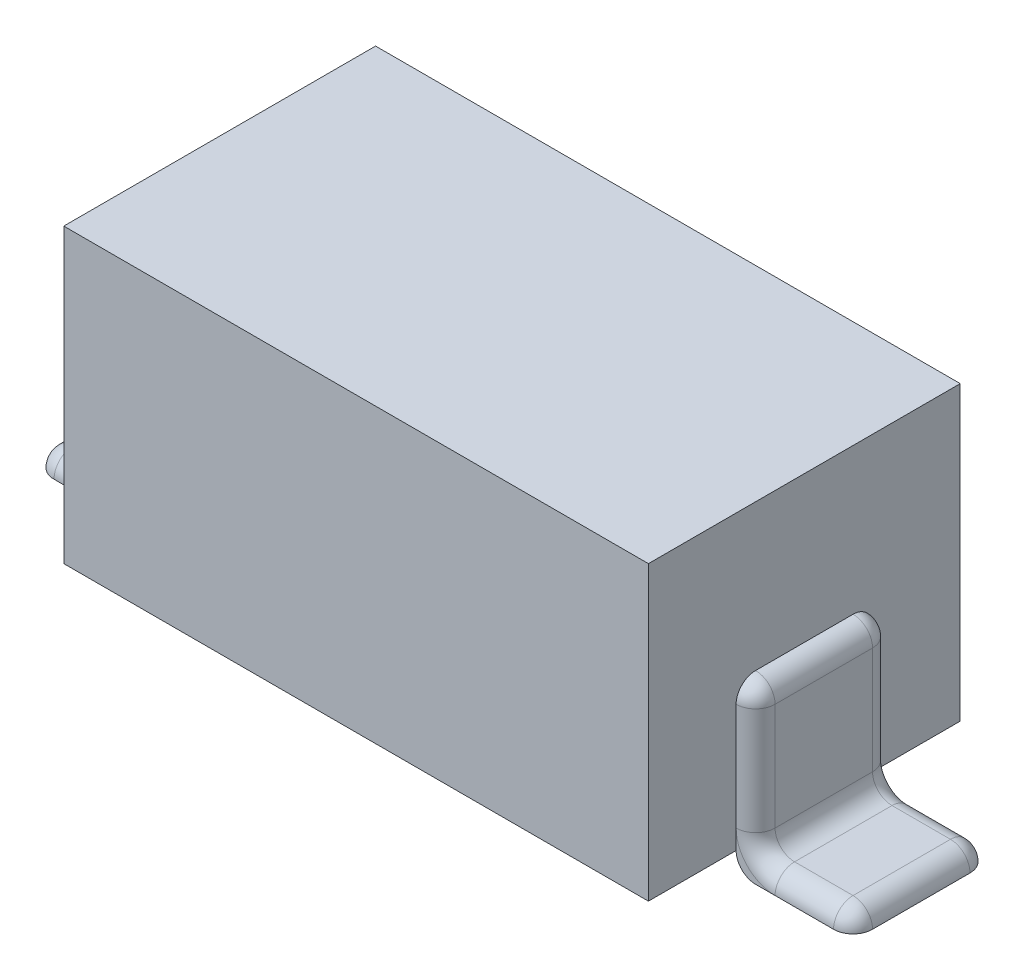
ISO-10303-21;
HEADER;
FILE_DESCRIPTION(('STEP AP214'),'2;1');
FILE_NAME('part.step','',(''),(''),'','','');
FILE_SCHEMA(('AUTOMOTIVE_DESIGN { 1 0 10303 214 1 1 1 1 }'));
ENDSEC;
DATA;
#1=APPLICATION_CONTEXT('core data for automotive mechanical design processes');
#2=APPLICATION_PROTOCOL_DEFINITION('international standard','automotive_design',2000,#1);
#3=PRODUCT_CONTEXT('',#1,'mechanical');
#4=PRODUCT('Part','Part','',(#3));
#5=PRODUCT_RELATED_PRODUCT_CATEGORY('part','',(#4));
#6=PRODUCT_DEFINITION_FORMATION('','',#4);
#7=PRODUCT_DEFINITION_CONTEXT('part definition',#1,'design');
#8=PRODUCT_DEFINITION('design','',#6,#7);
#9=PRODUCT_DEFINITION_SHAPE('','',#8);
#10=(LENGTH_UNIT() NAMED_UNIT(*) SI_UNIT(.MILLI.,.METRE.));
#11=(NAMED_UNIT(*) PLANE_ANGLE_UNIT() SI_UNIT($,.RADIAN.));
#12=(NAMED_UNIT(*) SI_UNIT($,.STERADIAN.) SOLID_ANGLE_UNIT());
#13=UNCERTAINTY_MEASURE_WITH_UNIT(LENGTH_MEASURE(1.E-05),#10,'distance_accuracy_value','');
#14=(GEOMETRIC_REPRESENTATION_CONTEXT(3) GLOBAL_UNCERTAINTY_ASSIGNED_CONTEXT((#13)) GLOBAL_UNIT_ASSIGNED_CONTEXT((#10,
#11,#12)) REPRESENTATION_CONTEXT('',''));
#15=CARTESIAN_POINT('',(0.,0.,0.));
#16=DIRECTION('',(0.,0.,1.));
#17=DIRECTION('',(1.,0.,0.));
#18=AXIS2_PLACEMENT_3D('',#15,#16,#17);
#19=CARTESIAN_POINT('',(-1.6,-0.85,0.35));
#20=DIRECTION('',(0.,0.,1.));
#21=DIRECTION('',(1.,0.,0.));
#22=AXIS2_PLACEMENT_3D('',#19,#20,#21);
#23=PLANE('',#22);
#24=DIRECTION('',(1.,0.,0.));
#25=VECTOR('',#24,1.);
#26=CARTESIAN_POINT('',(-1.6,-0.85,0.35));
#27=LINE('',#26,#25);
#28=CARTESIAN_POINT('',(-1.7,-0.85,0.35));
#29=VERTEX_POINT('',#28);
#30=CARTESIAN_POINT('',(-1.6,-0.85,0.35));
#31=VERTEX_POINT('',#30);
#32=EDGE_CURVE('E304',#29,#31,#27,.T.);
#33=ORIENTED_EDGE('',*,*,#32,.T.);
#34=CARTESIAN_POINT('',(-1.6,-0.75,0.35));
#35=DIRECTION('',(0.,0.,1.));
#36=DIRECTION('',(1.,0.,0.));
#37=AXIS2_PLACEMENT_3D('',#34,#35,#36);
#38=CIRCLE('',#37,0.1);
#39=CARTESIAN_POINT('',(-1.5,-0.75,0.35));
#40=VERTEX_POINT('',#39);
#41=EDGE_CURVE('E375',#31,#40,#38,.T.);
#42=ORIENTED_EDGE('',*,*,#41,.T.);
#43=DIRECTION('',(0.,-1.,0.));
#44=VECTOR('',#43,1.);
#45=CARTESIAN_POINT('',(-1.5,-0.85,0.35));
#46=LINE('',#45,#44);
#47=CARTESIAN_POINT('',(-1.5,-0.65,0.35));
#48=VERTEX_POINT('',#47);
#49=EDGE_CURVE('E309',#48,#40,#46,.T.);
#50=ORIENTED_EDGE('',*,*,#49,.F.);
#51=CARTESIAN_POINT('',(-1.7,-0.65,0.35));
#52=DIRECTION('',(0.,0.,1.));
#53=DIRECTION('',(1.,0.,0.));
#54=AXIS2_PLACEMENT_3D('',#51,#52,#53);
#55=CIRCLE('',#54,0.2);
#56=EDGE_CURVE('E377',#29,#48,#55,.T.);
#57=ORIENTED_EDGE('',*,*,#56,.F.);
#58=EDGE_LOOP('',(#33,#42,#50,#57));
#59=FACE_BOUND('',#58,.T.);
#60=ADVANCED_FACE('F35',(#59),#23,.T.);
#61=CARTESIAN_POINT('',(-1.6,-0.85,-0.35));
#62=DIRECTION('',(0.,0.,-1.));
#63=DIRECTION('',(-1.,0.,0.));
#64=AXIS2_PLACEMENT_3D('',#61,#62,#63);
#65=PLANE('',#64);
#66=CARTESIAN_POINT('',(-1.7,-0.65,-0.35));
#67=DIRECTION('',(0.,0.,-1.));
#68=DIRECTION('',(-1.,0.,0.));
#69=AXIS2_PLACEMENT_3D('',#66,#67,#68);
#70=CIRCLE('',#69,0.2);
#71=CARTESIAN_POINT('',(-1.5,-0.65,-0.35));
#72=VERTEX_POINT('',#71);
#73=CARTESIAN_POINT('',(-1.7,-0.85,-0.35));
#74=VERTEX_POINT('',#73);
#75=EDGE_CURVE('E227',#72,#74,#70,.T.);
#76=ORIENTED_EDGE('',*,*,#75,.F.);
#77=DIRECTION('',(0.,1.,0.));
#78=VECTOR('',#77,1.);
#79=CARTESIAN_POINT('',(-1.5,-0.85,-0.35));
#80=LINE('',#79,#78);
#81=CARTESIAN_POINT('',(-1.5,-0.75,-0.35));
#82=VERTEX_POINT('',#81);
#83=EDGE_CURVE('E228',#82,#72,#80,.T.);
#84=ORIENTED_EDGE('',*,*,#83,.F.);
#85=CARTESIAN_POINT('',(-1.6,-0.75,-0.35));
#86=DIRECTION('',(0.,0.,-1.));
#87=DIRECTION('',(-1.,0.,0.));
#88=AXIS2_PLACEMENT_3D('',#85,#86,#87);
#89=CIRCLE('',#88,0.1);
#90=CARTESIAN_POINT('',(-1.6,-0.85,-0.35));
#91=VERTEX_POINT('',#90);
#92=EDGE_CURVE('E218',#82,#91,#89,.T.);
#93=ORIENTED_EDGE('',*,*,#92,.T.);
#94=DIRECTION('',(1.,0.,0.));
#95=VECTOR('',#94,1.);
#96=CARTESIAN_POINT('',(-1.6,-0.85,-0.35));
#97=LINE('',#96,#95);
#98=EDGE_CURVE('E300',#74,#91,#97,.T.);
#99=ORIENTED_EDGE('',*,*,#98,.F.);
#100=EDGE_LOOP('',(#76,#84,#93,#99));
#101=FACE_BOUND('',#100,.T.);
#102=ADVANCED_FACE('F231',(#101),#65,.T.);
#103=CARTESIAN_POINT('',(1.6,-0.85,0.35));
#104=DIRECTION('',(0.,0.,-1.));
#105=DIRECTION('',(-1.,0.,0.));
#106=AXIS2_PLACEMENT_3D('',#103,#104,#105);
#107=PLANE('',#106);
#108=CARTESIAN_POINT('',(1.7,-0.65,0.35));
#109=DIRECTION('',(0.,0.,-1.));
#110=DIRECTION('',(-1.,0.,0.));
#111=AXIS2_PLACEMENT_3D('',#108,#109,#110);
#112=CIRCLE('',#111,0.2);
#113=CARTESIAN_POINT('',(1.5,-0.65,0.35));
#114=VERTEX_POINT('',#113);
#115=CARTESIAN_POINT('',(1.7,-0.85,0.35));
#116=VERTEX_POINT('',#115);
#117=EDGE_CURVE('E447',#114,#116,#112,.F.);
#118=ORIENTED_EDGE('',*,*,#117,.F.);
#119=DIRECTION('',(0.,-1.,0.));
#120=VECTOR('',#119,1.);
#121=CARTESIAN_POINT('',(1.5,-0.85,0.35));
#122=LINE('',#121,#120);
#123=CARTESIAN_POINT('',(1.5,-0.75,0.35));
#124=VERTEX_POINT('',#123);
#125=EDGE_CURVE('E286',#114,#124,#122,.T.);
#126=ORIENTED_EDGE('',*,*,#125,.T.);
#127=CARTESIAN_POINT('',(1.6,-0.75,0.35));
#128=DIRECTION('',(0.,0.,-1.));
#129=DIRECTION('',(-1.,0.,0.));
#130=AXIS2_PLACEMENT_3D('',#127,#128,#129);
#131=CIRCLE('',#130,0.1);
#132=CARTESIAN_POINT('',(1.6,-0.85,0.35));
#133=VERTEX_POINT('',#132);
#134=EDGE_CURVE('E450',#124,#133,#131,.F.);
#135=ORIENTED_EDGE('',*,*,#134,.T.);
#136=DIRECTION('',(-1.,0.,0.));
#137=VECTOR('',#136,1.);
#138=CARTESIAN_POINT('',(1.6,-0.85,0.35));
#139=LINE('',#138,#137);
#140=EDGE_CURVE('E277',#116,#133,#139,.T.);
#141=ORIENTED_EDGE('',*,*,#140,.F.);
#142=EDGE_LOOP('',(#118,#126,#135,#141));
#143=FACE_BOUND('',#142,.T.);
#144=ADVANCED_FACE('F502',(#143),#107,.F.);
#145=CARTESIAN_POINT('',(1.6,-0.85,-0.35));
#146=DIRECTION('',(0.,0.,1.));
#147=DIRECTION('',(1.,0.,0.));
#148=AXIS2_PLACEMENT_3D('',#145,#146,#147);
#149=PLANE('',#148);
#150=DIRECTION('',(-1.,0.,0.));
#151=VECTOR('',#150,1.);
#152=CARTESIAN_POINT('',(1.6,-0.85,-0.35));
#153=LINE('',#152,#151);
#154=CARTESIAN_POINT('',(1.7,-0.85,-0.35));
#155=VERTEX_POINT('',#154);
#156=CARTESIAN_POINT('',(1.6,-0.85,-0.35));
#157=VERTEX_POINT('',#156);
#158=EDGE_CURVE('E282',#155,#157,#153,.T.);
#159=ORIENTED_EDGE('',*,*,#158,.T.);
#160=CARTESIAN_POINT('',(1.6,-0.75,-0.35));
#161=DIRECTION('',(0.,0.,1.));
#162=DIRECTION('',(1.,0.,0.));
#163=AXIS2_PLACEMENT_3D('',#160,#161,#162);
#164=CIRCLE('',#163,0.1);
#165=CARTESIAN_POINT('',(1.5,-0.75,-0.35));
#166=VERTEX_POINT('',#165);
#167=EDGE_CURVE('E452',#157,#166,#164,.F.);
#168=ORIENTED_EDGE('',*,*,#167,.T.);
#169=DIRECTION('',(0.,1.,0.));
#170=VECTOR('',#169,1.);
#171=CARTESIAN_POINT('',(1.5,-0.85,-0.35));
#172=LINE('',#171,#170);
#173=CARTESIAN_POINT('',(1.5,-0.65,-0.35));
#174=VERTEX_POINT('',#173);
#175=EDGE_CURVE('E295',#166,#174,#172,.T.);
#176=ORIENTED_EDGE('',*,*,#175,.T.);
#177=CARTESIAN_POINT('',(1.7,-0.65,-0.35));
#178=DIRECTION('',(0.,0.,1.));
#179=DIRECTION('',(1.,0.,0.));
#180=AXIS2_PLACEMENT_3D('',#177,#178,#179);
#181=CIRCLE('',#180,0.2);
#182=EDGE_CURVE('E454',#155,#174,#181,.F.);
#183=ORIENTED_EDGE('',*,*,#182,.F.);
#184=EDGE_LOOP('',(#159,#168,#176,#183));
#185=FACE_BOUND('',#184,.T.);
#186=ADVANCED_FACE('F526',(#185),#149,.F.);
#187=CARTESIAN_POINT('',(1.6,0.,0.));
#188=DIRECTION('',(-1.,0.,0.));
#189=DIRECTION('',(0.,0.,1.));
#190=AXIS2_PLACEMENT_3D('',#187,#188,#189);
#191=PLANE('',#190);
#192=DIRECTION('',(0.,0.,1.));
#193=VECTOR('',#192,1.);
#194=CARTESIAN_POINT('',(1.6,-0.65,-0.35));
#195=LINE('',#194,#193);
#196=CARTESIAN_POINT('',(1.6,-0.65,0.25));
#197=VERTEX_POINT('',#196);
#198=CARTESIAN_POINT('',(1.6,-0.65,-0.25));
#199=VERTEX_POINT('',#198);
#200=EDGE_CURVE('E434',#197,#199,#195,.F.);
#201=ORIENTED_EDGE('',*,*,#200,.T.);
#202=DIRECTION('',(0.,1.,0.));
#203=VECTOR('',#202,1.);
#204=CARTESIAN_POINT('',(1.6,0.,-0.25));
#205=LINE('',#204,#203);
#206=CARTESIAN_POINT('',(1.6,-0.1,-0.25));
#207=VERTEX_POINT('',#206);
#208=EDGE_CURVE('E431',#199,#207,#205,.T.);
#209=ORIENTED_EDGE('',*,*,#208,.T.);
#210=DIRECTION('',(0.,0.,1.));
#211=VECTOR('',#210,1.);
#212=CARTESIAN_POINT('',(1.6,-0.1,0.));
#213=LINE('',#212,#211);
#214=CARTESIAN_POINT('',(1.6,-0.1,0.25));
#215=VERTEX_POINT('',#214);
#216=EDGE_CURVE('E436',#207,#215,#213,.T.);
#217=ORIENTED_EDGE('',*,*,#216,.T.);
#218=DIRECTION('',(0.,-1.,0.));
#219=VECTOR('',#218,1.);
#220=CARTESIAN_POINT('',(1.6,0.,0.25));
#221=LINE('',#220,#219);
#222=EDGE_CURVE('E438',#215,#197,#221,.T.);
#223=ORIENTED_EDGE('',*,*,#222,.T.);
#224=EDGE_LOOP('',(#201,#209,#217,#223));
#225=FACE_BOUND('',#224,.T.);
#226=ADVANCED_FACE('F578',(#225),#191,.F.);
#227=CARTESIAN_POINT('',(1.5,0.75,0.8));
#228=DIRECTION('',(-1.,0.,0.));
#229=DIRECTION('',(0.,0.,1.));
#230=AXIS2_PLACEMENT_3D('',#227,#228,#229);
#231=PLANE('',#230);
#232=ORIENTED_EDGE('',*,*,#175,.F.);
#233=DIRECTION('',(0.,0.,-1.));
#234=VECTOR('',#233,1.);
#235=CARTESIAN_POINT('',(1.5,-0.75,0.8));
#236=LINE('',#235,#234);
#237=CARTESIAN_POINT('',(1.5,-0.75,-0.8));
#238=VERTEX_POINT('',#237);
#239=EDGE_CURVE('E266',#166,#238,#236,.T.);
#240=ORIENTED_EDGE('',*,*,#239,.T.);
#241=DIRECTION('',(0.,-1.,0.));
#242=VECTOR('',#241,1.);
#243=CARTESIAN_POINT('',(1.5,0.75,-0.8));
#244=LINE('',#243,#242);
#245=CARTESIAN_POINT('',(1.5,0.75,-0.8));
#246=VERTEX_POINT('',#245);
#247=EDGE_CURVE('E296',#246,#238,#244,.T.);
#248=ORIENTED_EDGE('',*,*,#247,.F.);
#249=DIRECTION('',(0.,0.,-1.));
#250=VECTOR('',#249,1.);
#251=CARTESIAN_POINT('',(1.5,0.75,0.8));
#252=LINE('',#251,#250);
#253=CARTESIAN_POINT('',(1.5,0.75,0.8));
#254=VERTEX_POINT('',#253);
#255=EDGE_CURVE('E253',#254,#246,#252,.T.);
#256=ORIENTED_EDGE('',*,*,#255,.F.);
#257=DIRECTION('',(0.,-1.,0.));
#258=VECTOR('',#257,1.);
#259=CARTESIAN_POINT('',(1.5,0.75,0.8));
#260=LINE('',#259,#258);
#261=CARTESIAN_POINT('',(1.5,-0.75,0.8));
#262=VERTEX_POINT('',#261);
#263=EDGE_CURVE('E270',#254,#262,#260,.T.);
#264=ORIENTED_EDGE('',*,*,#263,.T.);
#265=EDGE_CURVE('E260',#262,#124,#236,.T.);
#266=ORIENTED_EDGE('',*,*,#265,.T.);
#267=ORIENTED_EDGE('',*,*,#125,.F.);
#268=CARTESIAN_POINT('',(1.5,-0.1,0.35));
#269=VERTEX_POINT('',#268);
#270=EDGE_CURVE('E285',#269,#114,#122,.T.);
#271=ORIENTED_EDGE('',*,*,#270,.F.);
#272=CARTESIAN_POINT('',(1.5,-0.1,0.25));
#273=DIRECTION('',(-1.,0.,0.));
#274=DIRECTION('',(0.,0.,1.));
#275=AXIS2_PLACEMENT_3D('',#272,#273,#274);
#276=CIRCLE('',#275,0.1);
#277=CARTESIAN_POINT('',(1.5,0.,0.25));
#278=VERTEX_POINT('',#277);
#279=EDGE_CURVE('E312',#269,#278,#276,.T.);
#280=ORIENTED_EDGE('',*,*,#279,.T.);
#281=DIRECTION('',(0.,0.,1.));
#282=VECTOR('',#281,1.);
#283=CARTESIAN_POINT('',(1.5,0.,0.35));
#284=LINE('',#283,#282);
#285=CARTESIAN_POINT('',(1.5,0.,-0.25));
#286=VERTEX_POINT('',#285);
#287=EDGE_CURVE('E288',#286,#278,#284,.T.);
#288=ORIENTED_EDGE('',*,*,#287,.F.);
#289=CARTESIAN_POINT('',(1.5,-0.1,-0.25));
#290=DIRECTION('',(-1.,0.,0.));
#291=DIRECTION('',(0.,0.,1.));
#292=AXIS2_PLACEMENT_3D('',#289,#290,#291);
#293=CIRCLE('',#292,0.1);
#294=CARTESIAN_POINT('',(1.5,-0.1,-0.35));
#295=VERTEX_POINT('',#294);
#296=EDGE_CURVE('E429',#286,#295,#293,.T.);
#297=ORIENTED_EDGE('',*,*,#296,.T.);
#298=EDGE_CURVE('E292',#174,#295,#172,.T.);
#299=ORIENTED_EDGE('',*,*,#298,.F.);
#300=EDGE_LOOP('',(#232,#240,#248,#256,#264,#266,#267,#271,#280,#288,#297,#299));
#301=FACE_BOUND('',#300,.T.);
#302=ADVANCED_FACE('F475',(#301),#231,.F.);
#303=CARTESIAN_POINT('',(-1.5,0.75,-0.8));
#304=DIRECTION('',(0.,0.,1.));
#305=DIRECTION('',(1.,0.,0.));
#306=AXIS2_PLACEMENT_3D('',#303,#304,#305);
#307=PLANE('',#306);
#308=DIRECTION('',(-1.,0.,0.));
#309=VECTOR('',#308,1.);
#310=CARTESIAN_POINT('',(-1.5,-0.75,-0.8));
#311=LINE('',#310,#309);
#312=CARTESIAN_POINT('',(-1.5,-0.75,-0.8));
#313=VERTEX_POINT('',#312);
#314=EDGE_CURVE('E256',#238,#313,#311,.T.);
#315=ORIENTED_EDGE('',*,*,#314,.T.);
#316=DIRECTION('',(0.,-1.,0.));
#317=VECTOR('',#316,1.);
#318=CARTESIAN_POINT('',(-1.5,0.75,-0.8));
#319=LINE('',#318,#317);
#320=CARTESIAN_POINT('',(-1.5,0.75,-0.8));
#321=VERTEX_POINT('',#320);
#322=EDGE_CURVE('E251',#321,#313,#319,.T.);
#323=ORIENTED_EDGE('',*,*,#322,.F.);
#324=DIRECTION('',(-1.,0.,0.));
#325=VECTOR('',#324,1.);
#326=CARTESIAN_POINT('',(-1.5,0.75,-0.8));
#327=LINE('',#326,#325);
#328=EDGE_CURVE('E273',#246,#321,#327,.T.);
#329=ORIENTED_EDGE('',*,*,#328,.F.);
#330=ORIENTED_EDGE('',*,*,#247,.T.);
#331=EDGE_LOOP('',(#315,#323,#329,#330));
#332=FACE_BOUND('',#331,.T.);
#333=ADVANCED_FACE('F599',(#332),#307,.F.);
#334=CARTESIAN_POINT('',(-1.5,0.75,0.8));
#335=DIRECTION('',(1.,0.,0.));
#336=DIRECTION('',(0.,0.,-1.));
#337=AXIS2_PLACEMENT_3D('',#334,#335,#336);
#338=PLANE('',#337);
#339=DIRECTION('',(0.,0.,1.));
#340=VECTOR('',#339,1.);
#341=CARTESIAN_POINT('',(-1.5,-0.75,0.8));
#342=LINE('',#341,#340);
#343=EDGE_CURVE('E243',#313,#82,#342,.T.);
#344=ORIENTED_EDGE('',*,*,#343,.T.);
#345=ORIENTED_EDGE('',*,*,#83,.T.);
#346=CARTESIAN_POINT('',(-1.5,-0.1,-0.35));
#347=VERTEX_POINT('',#346);
#348=EDGE_CURVE('E235',#72,#347,#80,.T.);
#349=ORIENTED_EDGE('',*,*,#348,.T.);
#350=CARTESIAN_POINT('',(-1.5,-0.1,-0.25));
#351=DIRECTION('',(1.,0.,0.));
#352=DIRECTION('',(0.,0.,-1.));
#353=AXIS2_PLACEMENT_3D('',#350,#351,#352);
#354=CIRCLE('',#353,0.1);
#355=CARTESIAN_POINT('',(-1.5,0.,-0.25));
#356=VERTEX_POINT('',#355);
#357=EDGE_CURVE('E44',#347,#356,#354,.T.);
#358=ORIENTED_EDGE('',*,*,#357,.T.);
#359=DIRECTION('',(0.,0.,1.));
#360=VECTOR('',#359,1.);
#361=CARTESIAN_POINT('',(-1.5,0.,0.35));
#362=LINE('',#361,#360);
#363=CARTESIAN_POINT('',(-1.5,0.,0.25));
#364=VERTEX_POINT('',#363);
#365=EDGE_CURVE('E51',#356,#364,#362,.T.);
#366=ORIENTED_EDGE('',*,*,#365,.T.);
#367=CARTESIAN_POINT('',(-1.5,-0.1,0.25));
#368=DIRECTION('',(1.,0.,0.));
#369=DIRECTION('',(0.,0.,-1.));
#370=AXIS2_PLACEMENT_3D('',#367,#368,#369);
#371=CIRCLE('',#370,0.1);
#372=CARTESIAN_POINT('',(-1.5,-0.1,0.35));
#373=VERTEX_POINT('',#372);
#374=EDGE_CURVE('E11',#364,#373,#371,.T.);
#375=ORIENTED_EDGE('',*,*,#374,.T.);
#376=EDGE_CURVE('E308',#373,#48,#46,.T.);
#377=ORIENTED_EDGE('',*,*,#376,.T.);
#378=ORIENTED_EDGE('',*,*,#49,.T.);
#379=CARTESIAN_POINT('',(-1.5,-0.75,0.8));
#380=VERTEX_POINT('',#379);
#381=EDGE_CURVE('E245',#40,#380,#342,.T.);
#382=ORIENTED_EDGE('',*,*,#381,.T.);
#383=DIRECTION('',(0.,-1.,0.));
#384=VECTOR('',#383,1.);
#385=CARTESIAN_POINT('',(-1.5,0.75,0.8));
#386=LINE('',#385,#384);
#387=CARTESIAN_POINT('',(-1.5,0.75,0.8));
#388=VERTEX_POINT('',#387);
#389=EDGE_CURVE('E468',#388,#380,#386,.T.);
#390=ORIENTED_EDGE('',*,*,#389,.F.);
#391=DIRECTION('',(0.,0.,1.));
#392=VECTOR('',#391,1.);
#393=CARTESIAN_POINT('',(-1.5,0.75,0.8));
#394=LINE('',#393,#392);
#395=EDGE_CURVE('E271',#321,#388,#394,.T.);
#396=ORIENTED_EDGE('',*,*,#395,.F.);
#397=ORIENTED_EDGE('',*,*,#322,.T.);
#398=EDGE_LOOP('',(#344,#345,#349,#358,#366,#375,#377,#378,#382,#390,#396,#397));
#399=FACE_BOUND('',#398,.T.);
#400=ADVANCED_FACE('F248',(#399),#338,.F.);
#401=CARTESIAN_POINT('',(-1.5,0.75,0.8));
#402=DIRECTION('',(0.,0.,-1.));
#403=DIRECTION('',(-1.,0.,0.));
#404=AXIS2_PLACEMENT_3D('',#401,#402,#403);
#405=PLANE('',#404);
#406=DIRECTION('',(1.,0.,0.));
#407=VECTOR('',#406,1.);
#408=CARTESIAN_POINT('',(-1.5,-0.75,0.8));
#409=LINE('',#408,#407);
#410=EDGE_CURVE('E252',#380,#262,#409,.T.);
#411=ORIENTED_EDGE('',*,*,#410,.T.);
#412=ORIENTED_EDGE('',*,*,#263,.F.);
#413=DIRECTION('',(1.,0.,0.));
#414=VECTOR('',#413,1.);
#415=CARTESIAN_POINT('',(-1.5,0.75,0.8));
#416=LINE('',#415,#414);
#417=EDGE_CURVE('E268',#388,#254,#416,.T.);
#418=ORIENTED_EDGE('',*,*,#417,.F.);
#419=ORIENTED_EDGE('',*,*,#389,.T.);
#420=EDGE_LOOP('',(#411,#412,#418,#419));
#421=FACE_BOUND('',#420,.T.);
#422=ADVANCED_FACE('F591',(#421),#405,.F.);
#423=CARTESIAN_POINT('',(0.,0.75,0.));
#424=DIRECTION('',(0.,-1.,0.));
#425=DIRECTION('',(0.,0.,-1.));
#426=AXIS2_PLACEMENT_3D('',#423,#424,#425);
#427=PLANE('',#426);
#428=ORIENTED_EDGE('',*,*,#255,.T.);
#429=ORIENTED_EDGE('',*,*,#328,.T.);
#430=ORIENTED_EDGE('',*,*,#395,.T.);
#431=ORIENTED_EDGE('',*,*,#417,.T.);
#432=EDGE_LOOP('',(#428,#429,#430,#431));
#433=FACE_BOUND('',#432,.T.);
#434=ADVANCED_FACE('F588',(#433),#427,.F.);
#435=CARTESIAN_POINT('',(0.,-0.75,0.));
#436=DIRECTION('',(0.,-1.,0.));
#437=DIRECTION('',(0.,0.,-1.));
#438=AXIS2_PLACEMENT_3D('',#435,#436,#437);
#439=PLANE('',#438);
#440=ORIENTED_EDGE('',*,*,#265,.F.);
#441=ORIENTED_EDGE('',*,*,#410,.F.);
#442=ORIENTED_EDGE('',*,*,#381,.F.);
#443=EDGE_CURVE('E222',#82,#40,#342,.T.);
#444=ORIENTED_EDGE('',*,*,#443,.F.);
#445=ORIENTED_EDGE('',*,*,#343,.F.);
#446=ORIENTED_EDGE('',*,*,#314,.F.);
#447=ORIENTED_EDGE('',*,*,#239,.F.);
#448=EDGE_CURVE('E264',#124,#166,#236,.T.);
#449=ORIENTED_EDGE('',*,*,#448,.F.);
#450=EDGE_LOOP('',(#440,#441,#442,#444,#445,#446,#447,#449));
#451=FACE_BOUND('',#450,.T.);
#452=ADVANCED_FACE('F241',(#451),#439,.T.);
#453=CARTESIAN_POINT('',(1.6,-0.85,0.35));
#454=DIRECTION('',(0.,1.,0.));
#455=DIRECTION('',(0.,0.,1.));
#456=AXIS2_PLACEMENT_3D('',#453,#454,#455);
#457=PLANE('',#456);
#458=CARTESIAN_POINT('',(2.,-0.85,-0.35));
#459=VERTEX_POINT('',#458);
#460=EDGE_CURVE('E281',#459,#155,#153,.T.);
#461=ORIENTED_EDGE('',*,*,#460,.F.);
#462=CARTESIAN_POINT('',(2.,-0.85,-0.25));
#463=DIRECTION('',(0.,1.,0.));
#464=DIRECTION('',(0.,0.,1.));
#465=AXIS2_PLACEMENT_3D('',#462,#463,#464);
#466=CIRCLE('',#465,0.1);
#467=CARTESIAN_POINT('',(2.1,-0.85,-0.25));
#468=VERTEX_POINT('',#467);
#469=EDGE_CURVE('E440',#459,#468,#466,.F.);
#470=ORIENTED_EDGE('',*,*,#469,.T.);
#471=DIRECTION('',(0.,0.,-1.));
#472=VECTOR('',#471,1.);
#473=CARTESIAN_POINT('',(2.1,-0.85,0.35));
#474=LINE('',#473,#472);
#475=CARTESIAN_POINT('',(2.1,-0.85,0.25));
#476=VERTEX_POINT('',#475);
#477=EDGE_CURVE('E291',#476,#468,#474,.T.);
#478=ORIENTED_EDGE('',*,*,#477,.F.);
#479=CARTESIAN_POINT('',(2.,-0.85,0.25));
#480=DIRECTION('',(0.,1.,0.));
#481=DIRECTION('',(0.,0.,1.));
#482=AXIS2_PLACEMENT_3D('',#479,#480,#481);
#483=CIRCLE('',#482,0.1);
#484=CARTESIAN_POINT('',(2.,-0.85,0.35));
#485=VERTEX_POINT('',#484);
#486=EDGE_CURVE('E442',#476,#485,#483,.F.);
#487=ORIENTED_EDGE('',*,*,#486,.T.);
#488=EDGE_CURVE('E280',#485,#116,#139,.T.);
#489=ORIENTED_EDGE('',*,*,#488,.T.);
#490=ORIENTED_EDGE('',*,*,#140,.T.);
#491=DIRECTION('',(0.,0.,-1.));
#492=VECTOR('',#491,1.);
#493=CARTESIAN_POINT('',(1.6,-0.85,-0.35));
#494=LINE('',#493,#492);
#495=EDGE_CURVE('E444',#133,#157,#494,.T.);
#496=ORIENTED_EDGE('',*,*,#495,.T.);
#497=ORIENTED_EDGE('',*,*,#158,.F.);
#498=EDGE_LOOP('',(#461,#470,#478,#487,#489,#490,#496,#497));
#499=FACE_BOUND('',#498,.T.);
#500=ADVANCED_FACE('F490',(#499),#457,.F.);
#501=CARTESIAN_POINT('',(2.1,-0.75,0.35));
#502=DIRECTION('',(0.,-1.,0.));
#503=DIRECTION('',(0.,0.,-1.));
#504=AXIS2_PLACEMENT_3D('',#501,#502,#503);
#505=PLANE('',#504);
#506=DIRECTION('',(-1.,0.,0.));
#507=VECTOR('',#506,1.);
#508=CARTESIAN_POINT('',(2.1,-0.75,0.25));
#509=LINE('',#508,#507);
#510=CARTESIAN_POINT('',(1.7,-0.75,0.25));
#511=VERTEX_POINT('',#510);
#512=CARTESIAN_POINT('',(2.,-0.75,0.25));
#513=VERTEX_POINT('',#512);
#514=EDGE_CURVE('E462',#511,#513,#509,.F.);
#515=ORIENTED_EDGE('',*,*,#514,.T.);
#516=DIRECTION('',(0.,0.,1.));
#517=VECTOR('',#516,1.);
#518=CARTESIAN_POINT('',(2.,-0.75,0.35));
#519=LINE('',#518,#517);
#520=CARTESIAN_POINT('',(2.,-0.75,-0.25));
#521=VERTEX_POINT('',#520);
#522=EDGE_CURVE('E457',#513,#521,#519,.F.);
#523=ORIENTED_EDGE('',*,*,#522,.T.);
#524=DIRECTION('',(-1.,0.,0.));
#525=VECTOR('',#524,1.);
#526=CARTESIAN_POINT('',(2.1,-0.75,-0.25));
#527=LINE('',#526,#525);
#528=CARTESIAN_POINT('',(1.7,-0.75,-0.25));
#529=VERTEX_POINT('',#528);
#530=EDGE_CURVE('E459',#521,#529,#527,.T.);
#531=ORIENTED_EDGE('',*,*,#530,.T.);
#532=DIRECTION('',(0.,0.,1.));
#533=VECTOR('',#532,1.);
#534=CARTESIAN_POINT('',(1.7,-0.75,0.35));
#535=LINE('',#534,#533);
#536=EDGE_CURVE('E464',#529,#511,#535,.T.);
#537=ORIENTED_EDGE('',*,*,#536,.T.);
#538=EDGE_LOOP('',(#515,#523,#531,#537));
#539=FACE_BOUND('',#538,.T.);
#540=ADVANCED_FACE('F544',(#539),#505,.F.);
#541=CARTESIAN_POINT('',(1.5,-0.1,0.25));
#542=DIRECTION('',(0.,0.,1.));
#543=DIRECTION('',(1.,0.,0.));
#544=AXIS2_PLACEMENT_3D('',#541,#542,#543);
#545=SPHERICAL_SURFACE('',#544,0.1);
#546=CARTESIAN_POINT('',(1.5,-0.1,0.25));
#547=DIRECTION('',(0.,0.,1.));
#548=DIRECTION('',(1.,0.,0.));
#549=AXIS2_PLACEMENT_3D('',#546,#547,#548);
#550=CIRCLE('',#549,0.1);
#551=EDGE_CURVE('E392',#278,#215,#550,.F.);
#552=ORIENTED_EDGE('',*,*,#551,.F.);
#553=ORIENTED_EDGE('',*,*,#279,.F.);
#554=CARTESIAN_POINT('',(1.5,-0.1,0.25));
#555=DIRECTION('',(0.,1.,0.));
#556=DIRECTION('',(-1.,0.,0.));
#557=AXIS2_PLACEMENT_3D('',#554,#555,#556);
#558=CIRCLE('',#557,0.1);
#559=EDGE_CURVE('E299',#215,#269,#558,.F.);
#560=ORIENTED_EDGE('',*,*,#559,.F.);
#561=EDGE_LOOP('',(#552,#553,#560));
#562=FACE_BOUND('',#561,.T.);
#563=ADVANCED_FACE('F511',(#562),#545,.T.);
#564=CARTESIAN_POINT('',(1.6,-0.85,0.25));
#565=DIRECTION('',(-1.,0.,0.));
#566=DIRECTION('',(0.,0.,1.));
#567=AXIS2_PLACEMENT_3D('',#564,#565,#566);
#568=CYLINDRICAL_SURFACE('',#567,0.1);
#569=CARTESIAN_POINT('',(1.7,-0.85,0.25));
#570=DIRECTION('',(-1.,0.,0.));
#571=DIRECTION('',(0.,0.,1.));
#572=AXIS2_PLACEMENT_3D('',#569,#570,#571);
#573=CIRCLE('',#572,0.1);
#574=EDGE_CURVE('E398',#116,#511,#573,.T.);
#575=ORIENTED_EDGE('',*,*,#574,.F.);
#576=ORIENTED_EDGE('',*,*,#488,.F.);
#577=CARTESIAN_POINT('',(2.,-0.85,0.25));
#578=DIRECTION('',(1.,0.,0.));
#579=DIRECTION('',(0.,0.,-1.));
#580=AXIS2_PLACEMENT_3D('',#577,#578,#579);
#581=CIRCLE('',#580,0.1);
#582=EDGE_CURVE('E395',#513,#485,#581,.T.);
#583=ORIENTED_EDGE('',*,*,#582,.F.);
#584=ORIENTED_EDGE('',*,*,#514,.F.);
#585=EDGE_LOOP('',(#575,#576,#583,#584));
#586=FACE_BOUND('',#585,.T.);
#587=ADVANCED_FACE('F496',(#586),#568,.T.);
#588=CARTESIAN_POINT('',(1.5,0.,0.25));
#589=DIRECTION('',(0.,-1.,0.));
#590=DIRECTION('',(0.,0.,-1.));
#591=AXIS2_PLACEMENT_3D('',#588,#589,#590);
#592=CYLINDRICAL_SURFACE('',#591,0.1);
#593=ORIENTED_EDGE('',*,*,#559,.T.);
#594=ORIENTED_EDGE('',*,*,#270,.T.);
#595=CARTESIAN_POINT('',(1.5,-0.65,0.25));
#596=DIRECTION('',(0.,-1.,0.));
#597=DIRECTION('',(0.,0.,-1.));
#598=AXIS2_PLACEMENT_3D('',#595,#596,#597);
#599=CIRCLE('',#598,0.1);
#600=EDGE_CURVE('E401',#197,#114,#599,.T.);
#601=ORIENTED_EDGE('',*,*,#600,.F.);
#602=ORIENTED_EDGE('',*,*,#222,.F.);
#603=EDGE_LOOP('',(#593,#594,#601,#602));
#604=FACE_BOUND('',#603,.T.);
#605=ADVANCED_FACE('F506',(#604),#592,.T.);
#606=CARTESIAN_POINT('',(1.5,-0.1,0.));
#607=DIRECTION('',(0.,0.,1.));
#608=DIRECTION('',(1.,0.,0.));
#609=AXIS2_PLACEMENT_3D('',#606,#607,#608);
#610=CYLINDRICAL_SURFACE('',#609,0.1);
#611=ORIENTED_EDGE('',*,*,#551,.T.);
#612=ORIENTED_EDGE('',*,*,#216,.F.);
#613=CARTESIAN_POINT('',(1.5,-0.1,-0.25));
#614=DIRECTION('',(0.,0.,-1.));
#615=DIRECTION('',(-1.,0.,0.));
#616=AXIS2_PLACEMENT_3D('',#613,#614,#615);
#617=CIRCLE('',#616,0.1);
#618=EDGE_CURVE('E404',#286,#207,#617,.T.);
#619=ORIENTED_EDGE('',*,*,#618,.F.);
#620=ORIENTED_EDGE('',*,*,#287,.T.);
#621=EDGE_LOOP('',(#611,#612,#619,#620));
#622=FACE_BOUND('',#621,.T.);
#623=ADVANCED_FACE('F517',(#622),#610,.T.);
#624=CARTESIAN_POINT('',(2.,-0.85,0.25));
#625=DIRECTION('',(0.,0.,1.));
#626=DIRECTION('',(1.,0.,0.));
#627=AXIS2_PLACEMENT_3D('',#624,#625,#626);
#628=SPHERICAL_SURFACE('',#627,0.1);
#629=ORIENTED_EDGE('',*,*,#582,.T.);
#630=ORIENTED_EDGE('',*,*,#486,.F.);
#631=CARTESIAN_POINT('',(2.,-0.85,0.25));
#632=DIRECTION('',(0.,0.,1.));
#633=DIRECTION('',(1.,0.,0.));
#634=AXIS2_PLACEMENT_3D('',#631,#632,#633);
#635=CIRCLE('',#634,0.1);
#636=EDGE_CURVE('E407',#513,#476,#635,.F.);
#637=ORIENTED_EDGE('',*,*,#636,.F.);
#638=EDGE_LOOP('',(#629,#630,#637));
#639=FACE_BOUND('',#638,.T.);
#640=ADVANCED_FACE('F553',(#639),#628,.T.);
#641=CARTESIAN_POINT('',(1.7,-0.65,0.25));
#642=DIRECTION('',(0.,0.,-1.));
#643=DIRECTION('',(-1.,0.,0.));
#644=AXIS2_PLACEMENT_3D('',#641,#642,#643);
#645=TOROIDAL_SURFACE('',#644,0.2,0.1);
#646=ORIENTED_EDGE('',*,*,#117,.T.);
#647=ORIENTED_EDGE('',*,*,#574,.T.);
#648=CARTESIAN_POINT('',(1.7,-0.65,0.25));
#649=DIRECTION('',(0.,0.,-1.));
#650=DIRECTION('',(-1.,0.,0.));
#651=AXIS2_PLACEMENT_3D('',#648,#649,#650);
#652=CIRCLE('',#651,0.1);
#653=EDGE_CURVE('E410',#197,#511,#652,.F.);
#654=ORIENTED_EDGE('',*,*,#653,.F.);
#655=ORIENTED_EDGE('',*,*,#600,.T.);
#656=EDGE_LOOP('',(#646,#647,#654,#655));
#657=FACE_BOUND('',#656,.T.);
#658=ADVANCED_FACE('F499',(#657),#645,.T.);
#659=CARTESIAN_POINT('',(1.5,-0.1,-0.25));
#660=DIRECTION('',(0.,0.,1.));
#661=DIRECTION('',(1.,0.,0.));
#662=AXIS2_PLACEMENT_3D('',#659,#660,#661);
#663=SPHERICAL_SURFACE('',#662,0.1);
#664=ORIENTED_EDGE('',*,*,#296,.F.);
#665=ORIENTED_EDGE('',*,*,#618,.T.);
#666=CARTESIAN_POINT('',(1.5,-0.1,-0.25));
#667=DIRECTION('',(0.,1.,0.));
#668=DIRECTION('',(0.,0.,1.));
#669=AXIS2_PLACEMENT_3D('',#666,#667,#668);
#670=CIRCLE('',#669,0.1);
#671=EDGE_CURVE('E413',#295,#207,#670,.F.);
#672=ORIENTED_EDGE('',*,*,#671,.F.);
#673=EDGE_LOOP('',(#664,#665,#672));
#674=FACE_BOUND('',#673,.T.);
#675=ADVANCED_FACE('F519',(#674),#663,.T.);
#676=CARTESIAN_POINT('',(2.,-0.85,0.));
#677=DIRECTION('',(0.,0.,1.));
#678=DIRECTION('',(1.,0.,0.));
#679=AXIS2_PLACEMENT_3D('',#676,#677,#678);
#680=CYLINDRICAL_SURFACE('',#679,0.1);
#681=ORIENTED_EDGE('',*,*,#636,.T.);
#682=ORIENTED_EDGE('',*,*,#477,.T.);
#683=CARTESIAN_POINT('',(2.,-0.85,-0.25));
#684=DIRECTION('',(0.,0.,-1.));
#685=DIRECTION('',(-1.,0.,0.));
#686=AXIS2_PLACEMENT_3D('',#683,#684,#685);
#687=CIRCLE('',#686,0.1);
#688=EDGE_CURVE('E415',#521,#468,#687,.T.);
#689=ORIENTED_EDGE('',*,*,#688,.F.);
#690=ORIENTED_EDGE('',*,*,#522,.F.);
#691=EDGE_LOOP('',(#681,#682,#689,#690));
#692=FACE_BOUND('',#691,.T.);
#693=ADVANCED_FACE('F548',(#692),#680,.T.);
#694=CARTESIAN_POINT('',(1.7,-0.65,0.35));
#695=DIRECTION('',(0.,0.,-1.));
#696=DIRECTION('',(-1.,0.,0.));
#697=AXIS2_PLACEMENT_3D('',#694,#695,#696);
#698=CYLINDRICAL_SURFACE('',#697,0.1);
#699=ORIENTED_EDGE('',*,*,#653,.T.);
#700=ORIENTED_EDGE('',*,*,#536,.F.);
#701=CARTESIAN_POINT('',(1.7,-0.65,-0.25));
#702=DIRECTION('',(0.,0.,1.));
#703=DIRECTION('',(1.,0.,0.));
#704=AXIS2_PLACEMENT_3D('',#701,#702,#703);
#705=CIRCLE('',#704,0.1);
#706=EDGE_CURVE('E418',#199,#529,#705,.T.);
#707=ORIENTED_EDGE('',*,*,#706,.F.);
#708=ORIENTED_EDGE('',*,*,#200,.F.);
#709=EDGE_LOOP('',(#699,#700,#707,#708));
#710=FACE_BOUND('',#709,.T.);
#711=ADVANCED_FACE('F542',(#710),#698,.F.);
#712=CARTESIAN_POINT('',(1.5,0.,-0.25));
#713=DIRECTION('',(0.,1.,0.));
#714=DIRECTION('',(0.,0.,1.));
#715=AXIS2_PLACEMENT_3D('',#712,#713,#714);
#716=CYLINDRICAL_SURFACE('',#715,0.1);
#717=ORIENTED_EDGE('',*,*,#671,.T.);
#718=ORIENTED_EDGE('',*,*,#208,.F.);
#719=CARTESIAN_POINT('',(1.5,-0.65,-0.25));
#720=DIRECTION('',(0.,-1.,0.));
#721=DIRECTION('',(0.,0.,-1.));
#722=AXIS2_PLACEMENT_3D('',#719,#720,#721);
#723=CIRCLE('',#722,0.1);
#724=EDGE_CURVE('E421',#174,#199,#723,.T.);
#725=ORIENTED_EDGE('',*,*,#724,.F.);
#726=ORIENTED_EDGE('',*,*,#298,.T.);
#727=EDGE_LOOP('',(#717,#718,#725,#726));
#728=FACE_BOUND('',#727,.T.);
#729=ADVANCED_FACE('F523',(#728),#716,.T.);
#730=CARTESIAN_POINT('',(2.,-0.85,-0.25));
#731=DIRECTION('',(0.,0.,1.));
#732=DIRECTION('',(1.,0.,0.));
#733=AXIS2_PLACEMENT_3D('',#730,#731,#732);
#734=SPHERICAL_SURFACE('',#733,0.1);
#735=ORIENTED_EDGE('',*,*,#688,.T.);
#736=ORIENTED_EDGE('',*,*,#469,.F.);
#737=CARTESIAN_POINT('',(2.,-0.85,-0.25));
#738=DIRECTION('',(1.,0.,0.));
#739=DIRECTION('',(0.,0.,-1.));
#740=AXIS2_PLACEMENT_3D('',#737,#738,#739);
#741=CIRCLE('',#740,0.1);
#742=EDGE_CURVE('E424',#521,#459,#741,.F.);
#743=ORIENTED_EDGE('',*,*,#742,.F.);
#744=EDGE_LOOP('',(#735,#736,#743));
#745=FACE_BOUND('',#744,.T.);
#746=ADVANCED_FACE('F550',(#745),#734,.T.);
#747=CARTESIAN_POINT('',(1.7,-0.65,-0.25));
#748=DIRECTION('',(0.,0.,1.));
#749=DIRECTION('',(1.,0.,0.));
#750=AXIS2_PLACEMENT_3D('',#747,#748,#749);
#751=TOROIDAL_SURFACE('',#750,0.2,0.1);
#752=ORIENTED_EDGE('',*,*,#724,.T.);
#753=ORIENTED_EDGE('',*,*,#706,.T.);
#754=CARTESIAN_POINT('',(1.7,-0.85,-0.25));
#755=DIRECTION('',(-1.,0.,0.));
#756=DIRECTION('',(0.,0.,1.));
#757=AXIS2_PLACEMENT_3D('',#754,#755,#756);
#758=CIRCLE('',#757,0.1);
#759=EDGE_CURVE('E426',#155,#529,#758,.F.);
#760=ORIENTED_EDGE('',*,*,#759,.F.);
#761=ORIENTED_EDGE('',*,*,#182,.T.);
#762=EDGE_LOOP('',(#752,#753,#760,#761));
#763=FACE_BOUND('',#762,.T.);
#764=ADVANCED_FACE('F537',(#763),#751,.T.);
#765=CARTESIAN_POINT('',(2.1,-0.85,-0.25));
#766=DIRECTION('',(-1.,0.,0.));
#767=DIRECTION('',(0.,0.,1.));
#768=AXIS2_PLACEMENT_3D('',#765,#766,#767);
#769=CYLINDRICAL_SURFACE('',#768,0.1);
#770=ORIENTED_EDGE('',*,*,#742,.T.);
#771=ORIENTED_EDGE('',*,*,#460,.T.);
#772=ORIENTED_EDGE('',*,*,#759,.T.);
#773=ORIENTED_EDGE('',*,*,#530,.F.);
#774=EDGE_LOOP('',(#770,#771,#772,#773));
#775=FACE_BOUND('',#774,.T.);
#776=ADVANCED_FACE('F532',(#775),#769,.T.);
#777=CARTESIAN_POINT('',(1.6,-0.75,0.35));
#778=DIRECTION('',(0.,0.,1.));
#779=DIRECTION('',(1.,0.,0.));
#780=AXIS2_PLACEMENT_3D('',#777,#778,#779);
#781=CYLINDRICAL_SURFACE('',#780,0.1);
#782=ORIENTED_EDGE('',*,*,#134,.F.);
#783=ORIENTED_EDGE('',*,*,#448,.T.);
#784=ORIENTED_EDGE('',*,*,#167,.F.);
#785=ORIENTED_EDGE('',*,*,#495,.F.);
#786=EDGE_LOOP('',(#782,#783,#784,#785));
#787=FACE_BOUND('',#786,.T.);
#788=ADVANCED_FACE('F528',(#787),#781,.T.);
#789=CARTESIAN_POINT('',(-1.6,-0.85,0.35));
#790=DIRECTION('',(0.,-1.,0.));
#791=DIRECTION('',(0.,0.,-1.));
#792=AXIS2_PLACEMENT_3D('',#789,#790,#791);
#793=PLANE('',#792);
#794=DIRECTION('',(0.,0.,-1.));
#795=VECTOR('',#794,1.);
#796=CARTESIAN_POINT('',(-2.1,-0.85,0.35));
#797=LINE('',#796,#795);
#798=CARTESIAN_POINT('',(-2.1,-0.85,0.25));
#799=VERTEX_POINT('',#798);
#800=CARTESIAN_POINT('',(-2.1,-0.85,-0.25));
#801=VERTEX_POINT('',#800);
#802=EDGE_CURVE('E310',#799,#801,#797,.T.);
#803=ORIENTED_EDGE('',*,*,#802,.T.);
#804=CARTESIAN_POINT('',(-2.,-0.85,-0.25));
#805=DIRECTION('',(0.,-1.,0.));
#806=DIRECTION('',(0.,0.,-1.));
#807=AXIS2_PLACEMENT_3D('',#804,#805,#806);
#808=CIRCLE('',#807,0.1);
#809=CARTESIAN_POINT('',(-2.,-0.85,-0.35));
#810=VERTEX_POINT('',#809);
#811=EDGE_CURVE('E370',#801,#810,#808,.T.);
#812=ORIENTED_EDGE('',*,*,#811,.T.);
#813=EDGE_CURVE('E302',#810,#74,#97,.T.);
#814=ORIENTED_EDGE('',*,*,#813,.T.);
#815=ORIENTED_EDGE('',*,*,#98,.T.);
#816=DIRECTION('',(0.,0.,-1.));
#817=VECTOR('',#816,1.);
#818=CARTESIAN_POINT('',(-1.6,-0.85,0.35));
#819=LINE('',#818,#817);
#820=EDGE_CURVE('E223',#91,#31,#819,.F.);
#821=ORIENTED_EDGE('',*,*,#820,.T.);
#822=ORIENTED_EDGE('',*,*,#32,.F.);
#823=CARTESIAN_POINT('',(-2.,-0.85,0.35));
#824=VERTEX_POINT('',#823);
#825=EDGE_CURVE('E303',#824,#29,#27,.T.);
#826=ORIENTED_EDGE('',*,*,#825,.F.);
#827=CARTESIAN_POINT('',(-2.,-0.85,0.25));
#828=DIRECTION('',(0.,-1.,0.));
#829=DIRECTION('',(0.,0.,-1.));
#830=AXIS2_PLACEMENT_3D('',#827,#828,#829);
#831=CIRCLE('',#830,0.1);
#832=EDGE_CURVE('E372',#824,#799,#831,.T.);
#833=ORIENTED_EDGE('',*,*,#832,.T.);
#834=EDGE_LOOP('',(#803,#812,#814,#815,#821,#822,#826,#833));
#835=FACE_BOUND('',#834,.T.);
#836=ADVANCED_FACE('F573',(#835),#793,.T.);
#837=CARTESIAN_POINT('',(-1.6,0.,0.));
#838=DIRECTION('',(1.,0.,0.));
#839=DIRECTION('',(0.,0.,1.));
#840=AXIS2_PLACEMENT_3D('',#837,#838,#839);
#841=PLANE('',#840);
#842=DIRECTION('',(0.,0.,1.));
#843=VECTOR('',#842,1.);
#844=CARTESIAN_POINT('',(-1.6,-0.1,-0.35));
#845=LINE('',#844,#843);
#846=CARTESIAN_POINT('',(-1.6,-0.1,0.25));
#847=VERTEX_POINT('',#846);
#848=CARTESIAN_POINT('',(-1.6,-0.1,-0.25));
#849=VERTEX_POINT('',#848);
#850=EDGE_CURVE('E366',#847,#849,#845,.F.);
#851=ORIENTED_EDGE('',*,*,#850,.T.);
#852=DIRECTION('',(0.,1.,0.));
#853=VECTOR('',#852,1.);
#854=CARTESIAN_POINT('',(-1.6,-0.75,-0.25));
#855=LINE('',#854,#853);
#856=CARTESIAN_POINT('',(-1.6,-0.65,-0.25));
#857=VERTEX_POINT('',#856);
#858=EDGE_CURVE('E361',#849,#857,#855,.F.);
#859=ORIENTED_EDGE('',*,*,#858,.T.);
#860=DIRECTION('',(0.,0.,1.));
#861=VECTOR('',#860,1.);
#862=CARTESIAN_POINT('',(-1.6,-0.65,0.));
#863=LINE('',#862,#861);
#864=CARTESIAN_POINT('',(-1.6,-0.65,0.25));
#865=VERTEX_POINT('',#864);
#866=EDGE_CURVE('E364',#857,#865,#863,.T.);
#867=ORIENTED_EDGE('',*,*,#866,.T.);
#868=DIRECTION('',(0.,-1.,0.));
#869=VECTOR('',#868,1.);
#870=CARTESIAN_POINT('',(-1.6,0.,0.25));
#871=LINE('',#870,#869);
#872=EDGE_CURVE('E368',#865,#847,#871,.F.);
#873=ORIENTED_EDGE('',*,*,#872,.T.);
#874=EDGE_LOOP('',(#851,#859,#867,#873));
#875=FACE_BOUND('',#874,.T.);
#876=ADVANCED_FACE('F571',(#875),#841,.F.);
#877=CARTESIAN_POINT('',(-2.1,-0.75,0.35));
#878=DIRECTION('',(0.,1.,0.));
#879=DIRECTION('',(0.,0.,1.));
#880=AXIS2_PLACEMENT_3D('',#877,#878,#879);
#881=PLANE('',#880);
#882=DIRECTION('',(1.,0.,0.));
#883=VECTOR('',#882,1.);
#884=CARTESIAN_POINT('',(-2.1,-0.75,-0.25));
#885=LINE('',#884,#883);
#886=CARTESIAN_POINT('',(-1.7,-0.75,-0.25));
#887=VERTEX_POINT('',#886);
#888=CARTESIAN_POINT('',(-2.,-0.75,-0.25));
#889=VERTEX_POINT('',#888);
#890=EDGE_CURVE('E382',#887,#889,#885,.F.);
#891=ORIENTED_EDGE('',*,*,#890,.T.);
#892=DIRECTION('',(0.,0.,1.));
#893=VECTOR('',#892,1.);
#894=CARTESIAN_POINT('',(-2.,-0.75,0.35));
#895=LINE('',#894,#893);
#896=CARTESIAN_POINT('',(-2.,-0.75,0.25));
#897=VERTEX_POINT('',#896);
#898=EDGE_CURVE('E380',#889,#897,#895,.T.);
#899=ORIENTED_EDGE('',*,*,#898,.T.);
#900=DIRECTION('',(1.,0.,0.));
#901=VECTOR('',#900,1.);
#902=CARTESIAN_POINT('',(-2.1,-0.75,0.25));
#903=LINE('',#902,#901);
#904=CARTESIAN_POINT('',(-1.7,-0.75,0.25));
#905=VERTEX_POINT('',#904);
#906=EDGE_CURVE('E385',#897,#905,#903,.T.);
#907=ORIENTED_EDGE('',*,*,#906,.T.);
#908=DIRECTION('',(0.,0.,1.));
#909=VECTOR('',#908,1.);
#910=CARTESIAN_POINT('',(-1.7,-0.75,0.35));
#911=LINE('',#910,#909);
#912=EDGE_CURVE('E387',#905,#887,#911,.F.);
#913=ORIENTED_EDGE('',*,*,#912,.T.);
#914=EDGE_LOOP('',(#891,#899,#907,#913));
#915=FACE_BOUND('',#914,.T.);
#916=ADVANCED_FACE('F663',(#915),#881,.T.);
#917=CARTESIAN_POINT('',(-1.5,-0.1,0.25));
#918=DIRECTION('',(0.,0.,1.));
#919=DIRECTION('',(1.,0.,0.));
#920=AXIS2_PLACEMENT_3D('',#917,#918,#919);
#921=SPHERICAL_SURFACE('',#920,0.1);
#922=CARTESIAN_POINT('',(-1.5,-0.1,0.25));
#923=DIRECTION('',(0.,1.,0.));
#924=DIRECTION('',(0.,0.,1.));
#925=AXIS2_PLACEMENT_3D('',#922,#923,#924);
#926=CIRCLE('',#925,0.1);
#927=EDGE_CURVE('E317',#373,#847,#926,.F.);
#928=ORIENTED_EDGE('',*,*,#927,.F.);
#929=ORIENTED_EDGE('',*,*,#374,.F.);
#930=CARTESIAN_POINT('',(-1.5,-0.1,0.25));
#931=DIRECTION('',(0.,0.,1.));
#932=DIRECTION('',(1.,0.,0.));
#933=AXIS2_PLACEMENT_3D('',#930,#931,#932);
#934=CIRCLE('',#933,0.1);
#935=EDGE_CURVE('E39',#847,#364,#934,.F.);
#936=ORIENTED_EDGE('',*,*,#935,.F.);
#937=EDGE_LOOP('',(#928,#929,#936));
#938=FACE_BOUND('',#937,.T.);
#939=ADVANCED_FACE('F670',(#938),#921,.T.);
#940=CARTESIAN_POINT('',(-1.5,-0.1,0.35));
#941=DIRECTION('',(0.,0.,-1.));
#942=DIRECTION('',(-1.,0.,0.));
#943=AXIS2_PLACEMENT_3D('',#940,#941,#942);
#944=CYLINDRICAL_SURFACE('',#943,0.1);
#945=ORIENTED_EDGE('',*,*,#935,.T.);
#946=ORIENTED_EDGE('',*,*,#365,.F.);
#947=CARTESIAN_POINT('',(-1.5,-0.1,-0.25));
#948=DIRECTION('',(0.,0.,-1.));
#949=DIRECTION('',(-1.,0.,0.));
#950=AXIS2_PLACEMENT_3D('',#947,#948,#949);
#951=CIRCLE('',#950,0.1);
#952=EDGE_CURVE('E328',#849,#356,#951,.T.);
#953=ORIENTED_EDGE('',*,*,#952,.F.);
#954=ORIENTED_EDGE('',*,*,#850,.F.);
#955=EDGE_LOOP('',(#945,#946,#953,#954));
#956=FACE_BOUND('',#955,.T.);
#957=ADVANCED_FACE('F677',(#956),#944,.T.);
#958=CARTESIAN_POINT('',(-1.5,-0.85,0.25));
#959=DIRECTION('',(0.,1.,0.));
#960=DIRECTION('',(0.,0.,1.));
#961=AXIS2_PLACEMENT_3D('',#958,#959,#960);
#962=CYLINDRICAL_SURFACE('',#961,0.1);
#963=ORIENTED_EDGE('',*,*,#927,.T.);
#964=ORIENTED_EDGE('',*,*,#872,.F.);
#965=CARTESIAN_POINT('',(-1.5,-0.65,0.25));
#966=DIRECTION('',(0.,-1.,0.));
#967=DIRECTION('',(0.,0.,-1.));
#968=AXIS2_PLACEMENT_3D('',#965,#966,#967);
#969=CIRCLE('',#968,0.1);
#970=EDGE_CURVE('E333',#48,#865,#969,.T.);
#971=ORIENTED_EDGE('',*,*,#970,.F.);
#972=ORIENTED_EDGE('',*,*,#376,.F.);
#973=EDGE_LOOP('',(#963,#964,#971,#972));
#974=FACE_BOUND('',#973,.T.);
#975=ADVANCED_FACE('F686',(#974),#962,.T.);
#976=CARTESIAN_POINT('',(-2.1,-0.85,0.25));
#977=DIRECTION('',(1.,0.,0.));
#978=DIRECTION('',(0.,0.,-1.));
#979=AXIS2_PLACEMENT_3D('',#976,#977,#978);
#980=CYLINDRICAL_SURFACE('',#979,0.1);
#981=CARTESIAN_POINT('',(-2.,-0.85,0.25));
#982=DIRECTION('',(-1.,0.,0.));
#983=DIRECTION('',(0.,0.,1.));
#984=AXIS2_PLACEMENT_3D('',#981,#982,#983);
#985=CIRCLE('',#984,0.1);
#986=EDGE_CURVE('E322',#824,#897,#985,.T.);
#987=ORIENTED_EDGE('',*,*,#986,.F.);
#988=ORIENTED_EDGE('',*,*,#825,.T.);
#989=CARTESIAN_POINT('',(-1.7,-0.85,0.25));
#990=DIRECTION('',(1.,0.,0.));
#991=DIRECTION('',(0.,0.,-1.));
#992=AXIS2_PLACEMENT_3D('',#989,#990,#991);
#993=CIRCLE('',#992,0.1);
#994=EDGE_CURVE('E336',#905,#29,#993,.T.);
#995=ORIENTED_EDGE('',*,*,#994,.F.);
#996=ORIENTED_EDGE('',*,*,#906,.F.);
#997=EDGE_LOOP('',(#987,#988,#995,#996));
#998=FACE_BOUND('',#997,.T.);
#999=ADVANCED_FACE('F694',(#998),#980,.T.);
#1000=CARTESIAN_POINT('',(-2.,-0.85,0.25));
#1001=DIRECTION('',(0.,0.,1.));
#1002=DIRECTION('',(1.,0.,0.));
#1003=AXIS2_PLACEMENT_3D('',#1000,#1001,#1002);
#1004=SPHERICAL_SURFACE('',#1003,0.1);
#1005=ORIENTED_EDGE('',*,*,#832,.F.);
#1006=ORIENTED_EDGE('',*,*,#986,.T.);
#1007=CARTESIAN_POINT('',(-2.,-0.85,0.25));
#1008=DIRECTION('',(0.,0.,1.));
#1009=DIRECTION('',(1.,0.,0.));
#1010=AXIS2_PLACEMENT_3D('',#1007,#1008,#1009);
#1011=CIRCLE('',#1010,0.1);
#1012=EDGE_CURVE('E339',#799,#897,#1011,.F.);
#1013=ORIENTED_EDGE('',*,*,#1012,.F.);
#1014=EDGE_LOOP('',(#1005,#1006,#1013));
#1015=FACE_BOUND('',#1014,.T.);
#1016=ADVANCED_FACE('F701',(#1015),#1004,.T.);
#1017=CARTESIAN_POINT('',(-1.5,-0.1,-0.25));
#1018=DIRECTION('',(0.,0.,1.));
#1019=DIRECTION('',(1.,0.,0.));
#1020=AXIS2_PLACEMENT_3D('',#1017,#1018,#1019);
#1021=SPHERICAL_SURFACE('',#1020,0.1);
#1022=ORIENTED_EDGE('',*,*,#952,.T.);
#1023=ORIENTED_EDGE('',*,*,#357,.F.);
#1024=CARTESIAN_POINT('',(-1.5,-0.1,-0.25));
#1025=DIRECTION('',(0.,1.,0.));
#1026=DIRECTION('',(-1.,0.,0.));
#1027=AXIS2_PLACEMENT_3D('',#1024,#1025,#1026);
#1028=CIRCLE('',#1027,0.1);
#1029=EDGE_CURVE('E342',#849,#347,#1028,.F.);
#1030=ORIENTED_EDGE('',*,*,#1029,.F.);
#1031=EDGE_LOOP('',(#1022,#1023,#1030));
#1032=FACE_BOUND('',#1031,.T.);
#1033=ADVANCED_FACE('F708',(#1032),#1021,.T.);
#1034=CARTESIAN_POINT('',(-1.7,-0.65,0.25));
#1035=DIRECTION('',(0.,0.,1.));
#1036=DIRECTION('',(1.,0.,0.));
#1037=AXIS2_PLACEMENT_3D('',#1034,#1035,#1036);
#1038=TOROIDAL_SURFACE('',#1037,0.2,0.1);
#1039=ORIENTED_EDGE('',*,*,#56,.T.);
#1040=ORIENTED_EDGE('',*,*,#970,.T.);
#1041=CARTESIAN_POINT('',(-1.7,-0.65,0.25));
#1042=DIRECTION('',(0.,0.,1.));
#1043=DIRECTION('',(1.,0.,0.));
#1044=AXIS2_PLACEMENT_3D('',#1041,#1042,#1043);
#1045=CIRCLE('',#1044,0.1);
#1046=EDGE_CURVE('E345',#905,#865,#1045,.T.);
#1047=ORIENTED_EDGE('',*,*,#1046,.F.);
#1048=ORIENTED_EDGE('',*,*,#994,.T.);
#1049=EDGE_LOOP('',(#1039,#1040,#1047,#1048));
#1050=FACE_BOUND('',#1049,.T.);
#1051=ADVANCED_FACE('F716',(#1050),#1038,.T.);
#1052=CARTESIAN_POINT('',(-2.,-0.85,0.35));
#1053=DIRECTION('',(0.,0.,-1.));
#1054=DIRECTION('',(-1.,0.,0.));
#1055=AXIS2_PLACEMENT_3D('',#1052,#1053,#1054);
#1056=CYLINDRICAL_SURFACE('',#1055,0.1);
#1057=ORIENTED_EDGE('',*,*,#1012,.T.);
#1058=ORIENTED_EDGE('',*,*,#898,.F.);
#1059=CARTESIAN_POINT('',(-2.,-0.85,-0.25));
#1060=DIRECTION('',(0.,0.,-1.));
#1061=DIRECTION('',(-1.,0.,0.));
#1062=AXIS2_PLACEMENT_3D('',#1059,#1060,#1061);
#1063=CIRCLE('',#1062,0.1);
#1064=EDGE_CURVE('E348',#801,#889,#1063,.T.);
#1065=ORIENTED_EDGE('',*,*,#1064,.F.);
#1066=ORIENTED_EDGE('',*,*,#802,.F.);
#1067=EDGE_LOOP('',(#1057,#1058,#1065,#1066));
#1068=FACE_BOUND('',#1067,.T.);
#1069=ADVANCED_FACE('F724',(#1068),#1056,.T.);
#1070=CARTESIAN_POINT('',(-1.5,-0.85,-0.25));
#1071=DIRECTION('',(0.,-1.,0.));
#1072=DIRECTION('',(0.,0.,-1.));
#1073=AXIS2_PLACEMENT_3D('',#1070,#1071,#1072);
#1074=CYLINDRICAL_SURFACE('',#1073,0.1);
#1075=ORIENTED_EDGE('',*,*,#1029,.T.);
#1076=ORIENTED_EDGE('',*,*,#348,.F.);
#1077=CARTESIAN_POINT('',(-1.5,-0.65,-0.25));
#1078=DIRECTION('',(0.,-1.,0.));
#1079=DIRECTION('',(0.,0.,-1.));
#1080=AXIS2_PLACEMENT_3D('',#1077,#1078,#1079);
#1081=CIRCLE('',#1080,0.1);
#1082=EDGE_CURVE('E351',#857,#72,#1081,.T.);
#1083=ORIENTED_EDGE('',*,*,#1082,.F.);
#1084=ORIENTED_EDGE('',*,*,#858,.F.);
#1085=EDGE_LOOP('',(#1075,#1076,#1083,#1084));
#1086=FACE_BOUND('',#1085,.T.);
#1087=ADVANCED_FACE('F732',(#1086),#1074,.T.);
#1088=CARTESIAN_POINT('',(-1.7,-0.65,0.));
#1089=DIRECTION('',(0.,0.,1.));
#1090=DIRECTION('',(1.,0.,0.));
#1091=AXIS2_PLACEMENT_3D('',#1088,#1089,#1090);
#1092=CYLINDRICAL_SURFACE('',#1091,0.1);
#1093=ORIENTED_EDGE('',*,*,#1046,.T.);
#1094=ORIENTED_EDGE('',*,*,#866,.F.);
#1095=CARTESIAN_POINT('',(-1.7,-0.65,-0.25));
#1096=DIRECTION('',(0.,0.,-1.));
#1097=DIRECTION('',(-1.,0.,0.));
#1098=AXIS2_PLACEMENT_3D('',#1095,#1096,#1097);
#1099=CIRCLE('',#1098,0.1);
#1100=EDGE_CURVE('E354',#887,#857,#1099,.F.);
#1101=ORIENTED_EDGE('',*,*,#1100,.F.);
#1102=ORIENTED_EDGE('',*,*,#912,.F.);
#1103=EDGE_LOOP('',(#1093,#1094,#1101,#1102));
#1104=FACE_BOUND('',#1103,.T.);
#1105=ADVANCED_FACE('F740',(#1104),#1092,.F.);
#1106=CARTESIAN_POINT('',(-2.,-0.85,-0.25));
#1107=DIRECTION('',(0.,0.,1.));
#1108=DIRECTION('',(1.,0.,0.));
#1109=AXIS2_PLACEMENT_3D('',#1106,#1107,#1108);
#1110=SPHERICAL_SURFACE('',#1109,0.1);
#1111=ORIENTED_EDGE('',*,*,#811,.F.);
#1112=ORIENTED_EDGE('',*,*,#1064,.T.);
#1113=CARTESIAN_POINT('',(-2.,-0.85,-0.25));
#1114=DIRECTION('',(-1.,0.,0.));
#1115=DIRECTION('',(0.,0.,1.));
#1116=AXIS2_PLACEMENT_3D('',#1113,#1114,#1115);
#1117=CIRCLE('',#1116,0.1);
#1118=EDGE_CURVE('E356',#810,#889,#1117,.F.);
#1119=ORIENTED_EDGE('',*,*,#1118,.F.);
#1120=EDGE_LOOP('',(#1111,#1112,#1119));
#1121=FACE_BOUND('',#1120,.T.);
#1122=ADVANCED_FACE('F747',(#1121),#1110,.T.);
#1123=CARTESIAN_POINT('',(-1.7,-0.65,-0.25));
#1124=DIRECTION('',(0.,0.,-1.));
#1125=DIRECTION('',(-1.,0.,0.));
#1126=AXIS2_PLACEMENT_3D('',#1123,#1124,#1125);
#1127=TOROIDAL_SURFACE('',#1126,0.2,0.1);
#1128=ORIENTED_EDGE('',*,*,#1082,.T.);
#1129=ORIENTED_EDGE('',*,*,#75,.T.);
#1130=CARTESIAN_POINT('',(-1.7,-0.85,-0.25));
#1131=DIRECTION('',(1.,0.,0.));
#1132=DIRECTION('',(0.,0.,-1.));
#1133=AXIS2_PLACEMENT_3D('',#1130,#1131,#1132);
#1134=CIRCLE('',#1133,0.1);
#1135=EDGE_CURVE('E358',#887,#74,#1134,.F.);
#1136=ORIENTED_EDGE('',*,*,#1135,.F.);
#1137=ORIENTED_EDGE('',*,*,#1100,.T.);
#1138=EDGE_LOOP('',(#1128,#1129,#1136,#1137));
#1139=FACE_BOUND('',#1138,.T.);
#1140=ADVANCED_FACE('F754',(#1139),#1127,.T.);
#1141=CARTESIAN_POINT('',(-1.6,-0.85,-0.25));
#1142=DIRECTION('',(1.,0.,0.));
#1143=DIRECTION('',(0.,0.,-1.));
#1144=AXIS2_PLACEMENT_3D('',#1141,#1142,#1143);
#1145=CYLINDRICAL_SURFACE('',#1144,0.1);
#1146=ORIENTED_EDGE('',*,*,#1118,.T.);
#1147=ORIENTED_EDGE('',*,*,#890,.F.);
#1148=ORIENTED_EDGE('',*,*,#1135,.T.);
#1149=ORIENTED_EDGE('',*,*,#813,.F.);
#1150=EDGE_LOOP('',(#1146,#1147,#1148,#1149));
#1151=FACE_BOUND('',#1150,.T.);
#1152=ADVANCED_FACE('F762',(#1151),#1145,.T.);
#1153=CARTESIAN_POINT('',(-1.6,-0.75,0.));
#1154=DIRECTION('',(0.,0.,-1.));
#1155=DIRECTION('',(-1.,0.,0.));
#1156=AXIS2_PLACEMENT_3D('',#1153,#1154,#1155);
#1157=CYLINDRICAL_SURFACE('',#1156,0.1);
#1158=ORIENTED_EDGE('',*,*,#41,.F.);
#1159=ORIENTED_EDGE('',*,*,#820,.F.);
#1160=ORIENTED_EDGE('',*,*,#92,.F.);
#1161=ORIENTED_EDGE('',*,*,#443,.T.);
#1162=EDGE_LOOP('',(#1158,#1159,#1160,#1161));
#1163=FACE_BOUND('',#1162,.T.);
#1164=ADVANCED_FACE('F37',(#1163),#1157,.T.);
#1165=CLOSED_SHELL('',(#60,#102,#144,#186,#226,#302,#333,#400,#422,#434,#452,#500,#540,#563,
#587,#605,#623,#640,#658,#675,#693,#711,#729,#746,#764,#776,#788,#836,#876,#916,#939,#957,#975,
#999,#1016,#1033,#1051,#1069,#1087,#1105,#1122,#1140,#1152,#1164));
#1166=MANIFOLD_SOLID_BREP('B2',#1165);
#1167=ADVANCED_BREP_SHAPE_REPRESENTATION('',(#18,#1166),#14);
#1168=SHAPE_DEFINITION_REPRESENTATION(#9,#1167);
ENDSEC;
END-ISO-10303-21;
